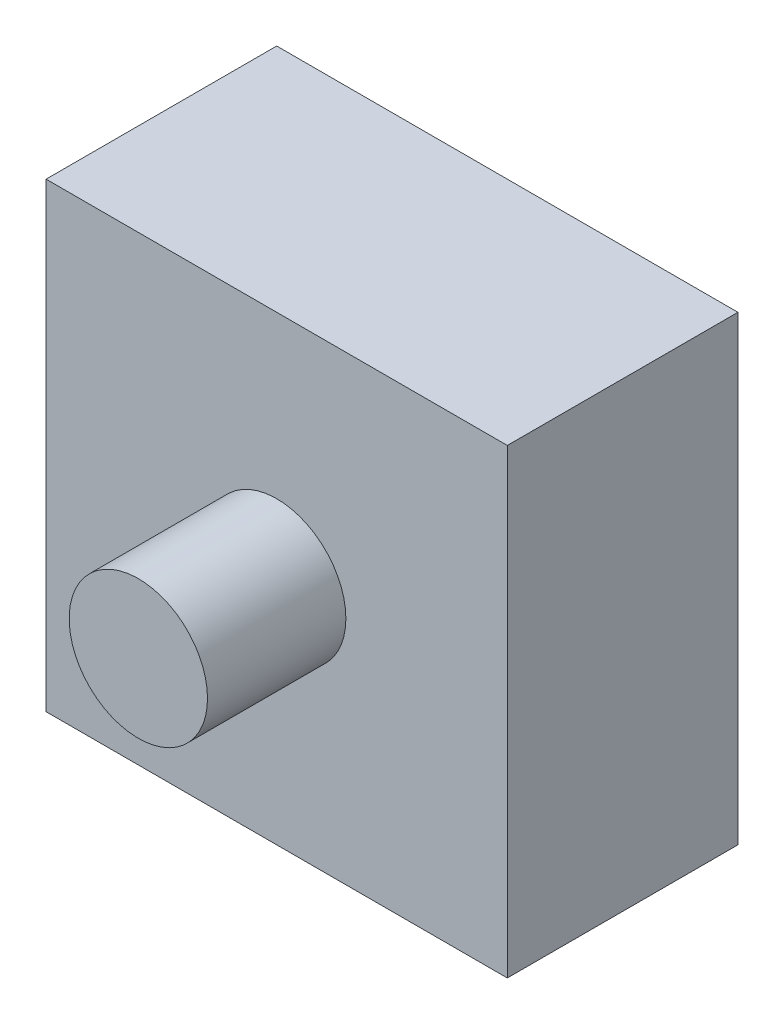
ISO-10303-21;
HEADER;
FILE_DESCRIPTION(('STEP AP214'),'2;1');
FILE_NAME('part.step','',(''),(''),'','','');
FILE_SCHEMA(('AUTOMOTIVE_DESIGN { 1 0 10303 214 1 1 1 1 }'));
ENDSEC;
DATA;
#1=APPLICATION_CONTEXT('core data for automotive mechanical design processes');
#2=APPLICATION_PROTOCOL_DEFINITION('international standard','automotive_design',2000,#1);
#3=PRODUCT_CONTEXT('',#1,'mechanical');
#4=PRODUCT('Part','Part','',(#3));
#5=PRODUCT_RELATED_PRODUCT_CATEGORY('part','',(#4));
#6=PRODUCT_DEFINITION_FORMATION('','',#4);
#7=PRODUCT_DEFINITION_CONTEXT('part definition',#1,'design');
#8=PRODUCT_DEFINITION('design','',#6,#7);
#9=PRODUCT_DEFINITION_SHAPE('','',#8);
#10=(LENGTH_UNIT() NAMED_UNIT(*) SI_UNIT(.MILLI.,.METRE.));
#11=(NAMED_UNIT(*) PLANE_ANGLE_UNIT() SI_UNIT($,.RADIAN.));
#12=(NAMED_UNIT(*) SI_UNIT($,.STERADIAN.) SOLID_ANGLE_UNIT());
#13=UNCERTAINTY_MEASURE_WITH_UNIT(LENGTH_MEASURE(1.E-05),#10,'distance_accuracy_value','');
#14=(GEOMETRIC_REPRESENTATION_CONTEXT(3) GLOBAL_UNCERTAINTY_ASSIGNED_CONTEXT((#13)) GLOBAL_UNIT_ASSIGNED_CONTEXT((#10,
#11,#12)) REPRESENTATION_CONTEXT('',''));
#15=CARTESIAN_POINT('',(0.,0.,0.));
#16=DIRECTION('',(0.,0.,1.));
#17=DIRECTION('',(1.,0.,0.));
#18=AXIS2_PLACEMENT_3D('',#15,#16,#17);
#19=CARTESIAN_POINT('',(-50.,50.,50.));
#20=DIRECTION('',(1.,0.,0.));
#21=DIRECTION('',(0.,1.,0.));
#22=AXIS2_PLACEMENT_3D('',#19,#20,#21);
#23=PLANE('',#22);
#24=DIRECTION('',(0.,-1.,0.));
#25=VECTOR('',#24,1.);
#26=CARTESIAN_POINT('',(-50.,50.,0.));
#27=LINE('',#26,#25);
#28=CARTESIAN_POINT('',(-50.,50.,0.));
#29=VERTEX_POINT('',#28);
#30=CARTESIAN_POINT('',(-50.,-50.,0.));
#31=VERTEX_POINT('',#30);
#32=EDGE_CURVE('E96',#29,#31,#27,.T.);
#33=ORIENTED_EDGE('',*,*,#32,.T.);
#34=DIRECTION('',(0.,0.,-1.));
#35=VECTOR('',#34,1.);
#36=CARTESIAN_POINT('',(-50.,-50.,50.));
#37=LINE('',#36,#35);
#38=CARTESIAN_POINT('',(-50.,-50.,50.));
#39=VERTEX_POINT('',#38);
#40=EDGE_CURVE('E11',#39,#31,#37,.T.);
#41=ORIENTED_EDGE('',*,*,#40,.F.);
#42=DIRECTION('',(0.,-1.,0.));
#43=VECTOR('',#42,1.);
#44=CARTESIAN_POINT('',(-50.,50.,50.));
#45=LINE('',#44,#43);
#46=CARTESIAN_POINT('',(-50.,50.,50.));
#47=VERTEX_POINT('',#46);
#48=EDGE_CURVE('E84',#47,#39,#45,.T.);
#49=ORIENTED_EDGE('',*,*,#48,.F.);
#50=DIRECTION('',(0.,0.,-1.));
#51=VECTOR('',#50,1.);
#52=CARTESIAN_POINT('',(-50.,50.,50.));
#53=LINE('',#52,#51);
#54=EDGE_CURVE('E92',#47,#29,#53,.T.);
#55=ORIENTED_EDGE('',*,*,#54,.T.);
#56=EDGE_LOOP('',(#33,#41,#49,#55));
#57=FACE_BOUND('',#56,.T.);
#58=ADVANCED_FACE('F33',(#57),#23,.F.);
#59=CARTESIAN_POINT('',(-50.,-50.,50.));
#60=DIRECTION('',(0.,1.,0.));
#61=DIRECTION('',(-1.,0.,0.));
#62=AXIS2_PLACEMENT_3D('',#59,#60,#61);
#63=PLANE('',#62);
#64=DIRECTION('',(1.,0.,0.));
#65=VECTOR('',#64,1.);
#66=CARTESIAN_POINT('',(-50.,-50.,0.));
#67=LINE('',#66,#65);
#68=CARTESIAN_POINT('',(50.0000000000001,-50.,0.));
#69=VERTEX_POINT('',#68);
#70=EDGE_CURVE('E88',#31,#69,#67,.T.);
#71=ORIENTED_EDGE('',*,*,#70,.T.);
#72=DIRECTION('',(0.,0.,-1.));
#73=VECTOR('',#72,1.);
#74=CARTESIAN_POINT('',(50.0000000000001,-50.,50.));
#75=LINE('',#74,#73);
#76=CARTESIAN_POINT('',(50.0000000000001,-50.,50.));
#77=VERTEX_POINT('',#76);
#78=EDGE_CURVE('E41',#77,#69,#75,.T.);
#79=ORIENTED_EDGE('',*,*,#78,.F.);
#80=DIRECTION('',(1.,0.,0.));
#81=VECTOR('',#80,1.);
#82=CARTESIAN_POINT('',(-50.,-50.,50.));
#83=LINE('',#82,#81);
#84=EDGE_CURVE('E79',#39,#77,#83,.T.);
#85=ORIENTED_EDGE('',*,*,#84,.F.);
#86=ORIENTED_EDGE('',*,*,#40,.T.);
#87=EDGE_LOOP('',(#71,#79,#85,#86));
#88=FACE_BOUND('',#87,.T.);
#89=ADVANCED_FACE('F87',(#88),#63,.F.);
#90=CARTESIAN_POINT('',(50.,50.,50.));
#91=DIRECTION('',(-1.,0.,0.));
#92=DIRECTION('',(0.,-1.,0.));
#93=AXIS2_PLACEMENT_3D('',#90,#91,#92);
#94=PLANE('',#93);
#95=DIRECTION('',(0.,1.,0.));
#96=VECTOR('',#95,1.);
#97=CARTESIAN_POINT('',(50.,50.,0.));
#98=LINE('',#97,#96);
#99=CARTESIAN_POINT('',(50.,50.,0.));
#100=VERTEX_POINT('',#99);
#101=EDGE_CURVE('E66',#69,#100,#98,.T.);
#102=ORIENTED_EDGE('',*,*,#101,.T.);
#103=DIRECTION('',(0.,0.,-1.));
#104=VECTOR('',#103,1.);
#105=CARTESIAN_POINT('',(50.,50.,50.));
#106=LINE('',#105,#104);
#107=CARTESIAN_POINT('',(50.,50.,50.));
#108=VERTEX_POINT('',#107);
#109=EDGE_CURVE('E89',#108,#100,#106,.T.);
#110=ORIENTED_EDGE('',*,*,#109,.F.);
#111=DIRECTION('',(0.,1.,0.));
#112=VECTOR('',#111,1.);
#113=CARTESIAN_POINT('',(50.,50.,50.));
#114=LINE('',#113,#112);
#115=EDGE_CURVE('E82',#77,#108,#114,.T.);
#116=ORIENTED_EDGE('',*,*,#115,.F.);
#117=ORIENTED_EDGE('',*,*,#78,.T.);
#118=EDGE_LOOP('',(#102,#110,#116,#117));
#119=FACE_BOUND('',#118,.T.);
#120=ADVANCED_FACE('F90',(#119),#94,.F.);
#121=CARTESIAN_POINT('',(-50.,50.,50.));
#122=DIRECTION('',(0.,-1.,0.));
#123=DIRECTION('',(1.,0.,0.));
#124=AXIS2_PLACEMENT_3D('',#121,#122,#123);
#125=PLANE('',#124);
#126=DIRECTION('',(-1.,0.,0.));
#127=VECTOR('',#126,1.);
#128=CARTESIAN_POINT('',(-50.,50.,0.));
#129=LINE('',#128,#127);
#130=EDGE_CURVE('E72',#100,#29,#129,.T.);
#131=ORIENTED_EDGE('',*,*,#130,.T.);
#132=ORIENTED_EDGE('',*,*,#54,.F.);
#133=DIRECTION('',(-1.,0.,0.));
#134=VECTOR('',#133,1.);
#135=CARTESIAN_POINT('',(-50.,50.,50.));
#136=LINE('',#135,#134);
#137=EDGE_CURVE('E49',#108,#47,#136,.T.);
#138=ORIENTED_EDGE('',*,*,#137,.F.);
#139=ORIENTED_EDGE('',*,*,#109,.T.);
#140=EDGE_LOOP('',(#131,#132,#138,#139));
#141=FACE_BOUND('',#140,.T.);
#142=ADVANCED_FACE('F104',(#141),#125,.F.);
#143=CARTESIAN_POINT('',(0.,0.,50.));
#144=DIRECTION('',(0.,0.,1.));
#145=DIRECTION('',(1.,0.,0.));
#146=AXIS2_PLACEMENT_3D('',#143,#144,#145);
#147=PLANE('',#146);
#148=CARTESIAN_POINT('',(0.,0.,50.));
#149=DIRECTION('',(0.,0.,1.));
#150=DIRECTION('',(1.,0.,0.));
#151=AXIS2_PLACEMENT_3D('',#148,#149,#150);
#152=CIRCLE('',#151,15.);
#153=CARTESIAN_POINT('',(15.,0.,50.));
#154=VERTEX_POINT('',#153);
#155=EDGE_CURVE('E110',#154,#154,#152,.T.);
#156=ORIENTED_EDGE('',*,*,#155,.F.);
#157=EDGE_LOOP('',(#156));
#158=FACE_BOUND('',#157,.T.);
#159=ORIENTED_EDGE('',*,*,#48,.T.);
#160=ORIENTED_EDGE('',*,*,#84,.T.);
#161=ORIENTED_EDGE('',*,*,#115,.T.);
#162=ORIENTED_EDGE('',*,*,#137,.T.);
#163=EDGE_LOOP('',(#159,#160,#161,#162));
#164=FACE_BOUND('',#163,.T.);
#165=ADVANCED_FACE('F80',(#158,#164),#147,.T.);
#166=CARTESIAN_POINT('',(0.,0.,0.));
#167=DIRECTION('',(0.,0.,1.));
#168=DIRECTION('',(1.,0.,0.));
#169=AXIS2_PLACEMENT_3D('',#166,#167,#168);
#170=PLANE('',#169);
#171=ORIENTED_EDGE('',*,*,#32,.F.);
#172=ORIENTED_EDGE('',*,*,#130,.F.);
#173=ORIENTED_EDGE('',*,*,#101,.F.);
#174=ORIENTED_EDGE('',*,*,#70,.F.);
#175=EDGE_LOOP('',(#171,#172,#173,#174));
#176=FACE_BOUND('',#175,.T.);
#177=ADVANCED_FACE('F107',(#176),#170,.F.);
#178=CARTESIAN_POINT('',(0.,0.,80.));
#179=DIRECTION('',(0.,0.,-1.));
#180=DIRECTION('',(-1.,0.,0.));
#181=AXIS2_PLACEMENT_3D('',#178,#179,#180);
#182=CYLINDRICAL_SURFACE('',#181,15.);
#183=CARTESIAN_POINT('',(0.,0.,80.));
#184=DIRECTION('',(0.,0.,1.));
#185=DIRECTION('',(1.,0.,0.));
#186=AXIS2_PLACEMENT_3D('',#183,#184,#185);
#187=CIRCLE('',#186,15.);
#188=CARTESIAN_POINT('',(15.,0.,80.));
#189=VERTEX_POINT('',#188);
#190=EDGE_CURVE('E99',#189,#189,#187,.T.);
#191=ORIENTED_EDGE('',*,*,#190,.F.);
#192=EDGE_LOOP('',(#191));
#193=FACE_BOUND('',#192,.T.);
#194=ORIENTED_EDGE('',*,*,#155,.T.);
#195=EDGE_LOOP('',(#194));
#196=FACE_BOUND('',#195,.T.);
#197=ADVANCED_FACE('F118',(#193,#196),#182,.T.);
#198=CARTESIAN_POINT('',(0.,0.,80.));
#199=DIRECTION('',(0.,0.,1.));
#200=DIRECTION('',(1.,0.,0.));
#201=AXIS2_PLACEMENT_3D('',#198,#199,#200);
#202=PLANE('',#201);
#203=ORIENTED_EDGE('',*,*,#190,.T.);
#204=EDGE_LOOP('',(#203));
#205=FACE_BOUND('',#204,.T.);
#206=ADVANCED_FACE('F116',(#205),#202,.T.);
#207=CLOSED_SHELL('',(#58,#89,#120,#142,#165,#177,#197,#206));
#208=MANIFOLD_SOLID_BREP('B2',#207);
#209=ADVANCED_BREP_SHAPE_REPRESENTATION('',(#18,#208),#14);
#210=SHAPE_DEFINITION_REPRESENTATION(#9,#209);
ENDSEC;
END-ISO-10303-21;
